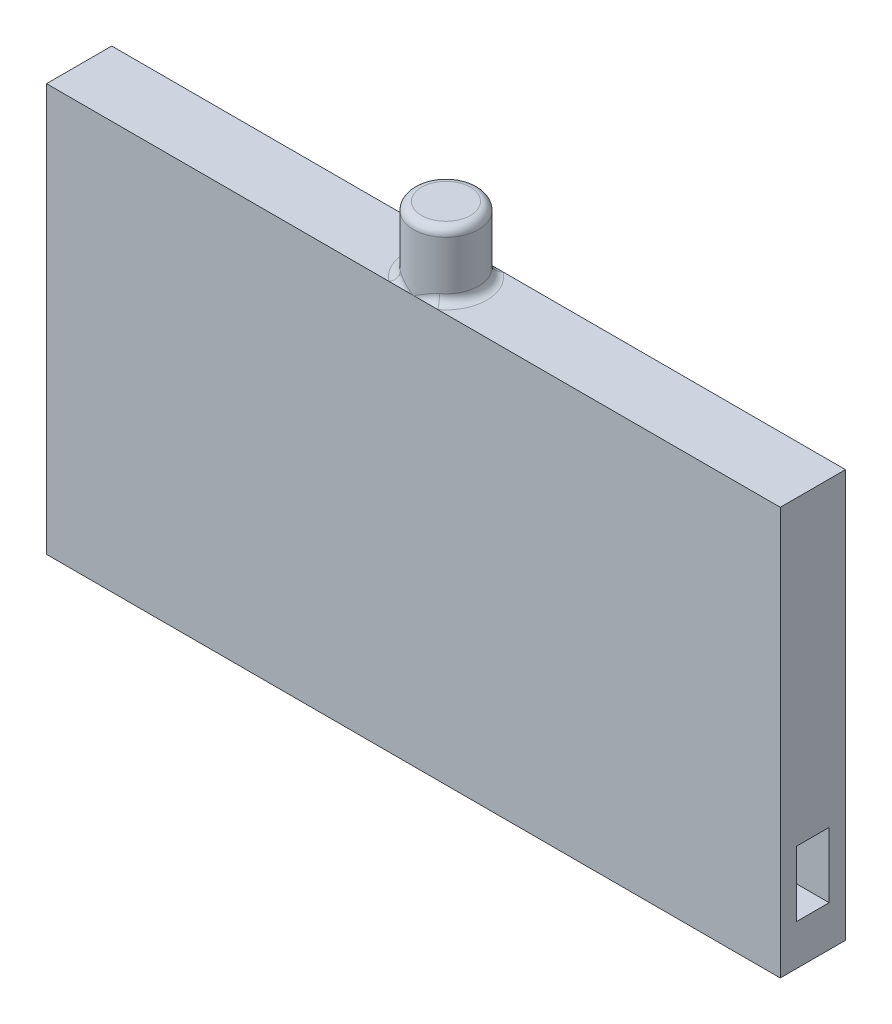
ISO-10303-21;
HEADER;
FILE_DESCRIPTION(('STEP AP214'),'2;1');
FILE_NAME('part.step','',(''),(''),'','','');
FILE_SCHEMA(('AUTOMOTIVE_DESIGN { 1 0 10303 214 1 1 1 1 }'));
ENDSEC;
DATA;
#1=APPLICATION_CONTEXT('core data for automotive mechanical design processes');
#2=APPLICATION_PROTOCOL_DEFINITION('international standard','automotive_design',2000,#1);
#3=PRODUCT_CONTEXT('',#1,'mechanical');
#4=PRODUCT('Part','Part','',(#3));
#5=PRODUCT_RELATED_PRODUCT_CATEGORY('part','',(#4));
#6=PRODUCT_DEFINITION_FORMATION('','',#4);
#7=PRODUCT_DEFINITION_CONTEXT('part definition',#1,'design');
#8=PRODUCT_DEFINITION('design','',#6,#7);
#9=PRODUCT_DEFINITION_SHAPE('','',#8);
#10=(LENGTH_UNIT() NAMED_UNIT(*) SI_UNIT(.MILLI.,.METRE.));
#11=(NAMED_UNIT(*) PLANE_ANGLE_UNIT() SI_UNIT($,.RADIAN.));
#12=(NAMED_UNIT(*) SI_UNIT($,.STERADIAN.) SOLID_ANGLE_UNIT());
#13=UNCERTAINTY_MEASURE_WITH_UNIT(LENGTH_MEASURE(1.E-05),#10,'distance_accuracy_value','');
#14=(GEOMETRIC_REPRESENTATION_CONTEXT(3) GLOBAL_UNCERTAINTY_ASSIGNED_CONTEXT((#13)) GLOBAL_UNIT_ASSIGNED_CONTEXT((#10,
#11,#12)) REPRESENTATION_CONTEXT('',''));
#15=CARTESIAN_POINT('',(0.,0.,0.));
#16=DIRECTION('',(0.,0.,1.));
#17=DIRECTION('',(1.,0.,0.));
#18=AXIS2_PLACEMENT_3D('',#15,#16,#17);
#19=CARTESIAN_POINT('',(0.,12.7,0.));
#20=DIRECTION('',(0.,-1.,0.));
#21=DIRECTION('',(0.,0.,1.));
#22=AXIS2_PLACEMENT_3D('',#19,#20,#21);
#23=PLANE('',#22);
#24=DIRECTION('',(-1.,0.,0.));
#25=VECTOR('',#24,1.);
#26=CARTESIAN_POINT('',(-9.906,12.7,15.7398333107177));
#27=LINE('',#26,#25);
#28=CARTESIAN_POINT('',(12.954,12.7,15.7398333107177));
#29=VERTEX_POINT('',#28);
#30=CARTESIAN_POINT('',(2.286,12.7,15.7398333107177));
#31=VERTEX_POINT('',#30);
#32=EDGE_CURVE('E192',#29,#31,#27,.T.);
#33=ORIENTED_EDGE('',*,*,#32,.F.);
#34=DIRECTION('',(0.,0.,1.));
#35=VECTOR('',#34,1.);
#36=CARTESIAN_POINT('',(12.954,12.7,13.7078333107177));
#37=LINE('',#36,#35);
#38=CARTESIAN_POINT('',(12.954,12.7,13.7078333107177));
#39=VERTEX_POINT('',#38);
#40=EDGE_CURVE('E186',#39,#29,#37,.T.);
#41=ORIENTED_EDGE('',*,*,#40,.F.);
#42=DIRECTION('',(1.,0.,0.));
#43=VECTOR('',#42,1.);
#44=CARTESIAN_POINT('',(-9.906,12.7,13.7078333107177));
#45=LINE('',#44,#43);
#46=CARTESIAN_POINT('',(2.286,12.7,13.7078333107177));
#47=VERTEX_POINT('',#46);
#48=EDGE_CURVE('E181',#47,#39,#45,.T.);
#49=ORIENTED_EDGE('',*,*,#48,.F.);
#50=CARTESIAN_POINT('',(1.524,12.7,14.7238333107177));
#51=DIRECTION('',(0.,1.,0.));
#52=DIRECTION('',(0.,0.,1.));
#53=AXIS2_PLACEMENT_3D('',#50,#51,#52);
#54=CIRCLE('',#53,1.27);
#55=EDGE_CURVE('E11',#31,#47,#54,.T.);
#56=ORIENTED_EDGE('',*,*,#55,.F.);
#57=EDGE_LOOP('',(#33,#41,#49,#56));
#58=FACE_BOUND('',#57,.T.);
#59=ADVANCED_FACE('F39',(#58),#23,.F.);
#60=CARTESIAN_POINT('',(-9.906,12.7,13.7078333107177));
#61=DIRECTION('',(1.,0.,0.));
#62=DIRECTION('',(0.,0.,1.));
#63=AXIS2_PLACEMENT_3D('',#60,#61,#62);
#64=PLANE('',#63);
#65=DIRECTION('',(0.,0.,-1.));
#66=VECTOR('',#65,1.);
#67=CARTESIAN_POINT('',(-9.906,0.,13.7078333107177));
#68=LINE('',#67,#66);
#69=CARTESIAN_POINT('',(-9.906,0.,15.7398333107177));
#70=VERTEX_POINT('',#69);
#71=CARTESIAN_POINT('',(-9.906,0.,13.7078333107177));
#72=VERTEX_POINT('',#71);
#73=EDGE_CURVE('E198',#70,#72,#68,.T.);
#74=ORIENTED_EDGE('',*,*,#73,.F.);
#75=DIRECTION('',(0.,-1.,0.));
#76=VECTOR('',#75,1.);
#77=CARTESIAN_POINT('',(-9.906,12.7,15.7398333107177));
#78=LINE('',#77,#76);
#79=CARTESIAN_POINT('',(-9.906,12.7,15.7398333107177));
#80=VERTEX_POINT('',#79);
#81=EDGE_CURVE('E195',#80,#70,#78,.T.);
#82=ORIENTED_EDGE('',*,*,#81,.F.);
#83=DIRECTION('',(0.,0.,-1.));
#84=VECTOR('',#83,1.);
#85=CARTESIAN_POINT('',(-9.906,12.7,13.7078333107177));
#86=LINE('',#85,#84);
#87=CARTESIAN_POINT('',(-9.906,12.7,13.7078333107177));
#88=VERTEX_POINT('',#87);
#89=EDGE_CURVE('E178',#80,#88,#86,.T.);
#90=ORIENTED_EDGE('',*,*,#89,.T.);
#91=DIRECTION('',(0.,-1.,0.));
#92=VECTOR('',#91,1.);
#93=CARTESIAN_POINT('',(-9.906,12.7,13.7078333107177));
#94=LINE('',#93,#92);
#95=EDGE_CURVE('E217',#88,#72,#94,.T.);
#96=ORIENTED_EDGE('',*,*,#95,.T.);
#97=EDGE_LOOP('',(#74,#82,#90,#96));
#98=FACE_BOUND('',#97,.T.);
#99=ADVANCED_FACE('F352',(#98),#64,.F.);
#100=CARTESIAN_POINT('',(-9.906,12.7,13.7078333107177));
#101=DIRECTION('',(0.,0.,1.));
#102=DIRECTION('',(-1.,0.,0.));
#103=AXIS2_PLACEMENT_3D('',#100,#101,#102);
#104=PLANE('',#103);
#105=DIRECTION('',(1.,0.,0.));
#106=VECTOR('',#105,1.);
#107=CARTESIAN_POINT('',(-9.906,0.,13.7078333107177));
#108=LINE('',#107,#106);
#109=CARTESIAN_POINT('',(12.954,0.,13.7078333107177));
#110=VERTEX_POINT('',#109);
#111=EDGE_CURVE('E201',#72,#110,#108,.T.);
#112=ORIENTED_EDGE('',*,*,#111,.F.);
#113=ORIENTED_EDGE('',*,*,#95,.F.);
#114=CARTESIAN_POINT('',(0.762000000000002,12.7,13.7078333107177));
#115=VERTEX_POINT('',#114);
#116=EDGE_CURVE('E183',#88,#115,#45,.T.);
#117=ORIENTED_EDGE('',*,*,#116,.T.);
#118=CARTESIAN_POINT('',(1.524,12.7,13.7078333107177));
#119=VERTEX_POINT('',#118);
#120=EDGE_CURVE('E187',#115,#119,#45,.T.);
#121=ORIENTED_EDGE('',*,*,#120,.T.);
#122=EDGE_CURVE('E188',#119,#47,#45,.T.);
#123=ORIENTED_EDGE('',*,*,#122,.T.);
#124=ORIENTED_EDGE('',*,*,#48,.T.);
#125=DIRECTION('',(0.,-1.,0.));
#126=VECTOR('',#125,1.);
#127=CARTESIAN_POINT('',(12.954,12.7,13.7078333107177));
#128=LINE('',#127,#126);
#129=EDGE_CURVE('E214',#39,#110,#128,.T.);
#130=ORIENTED_EDGE('',*,*,#129,.T.);
#131=EDGE_LOOP('',(#112,#113,#117,#121,#123,#124,#130));
#132=FACE_BOUND('',#131,.T.);
#133=ADVANCED_FACE('F348',(#132),#104,.F.);
#134=CARTESIAN_POINT('',(12.954,12.7,13.7078333107177));
#135=DIRECTION('',(-1.,0.,0.));
#136=DIRECTION('',(0.,0.,-1.));
#137=AXIS2_PLACEMENT_3D('',#134,#135,#136);
#138=PLANE('',#137);
#139=DIRECTION('',(0.,0.,1.));
#140=VECTOR('',#139,1.);
#141=CARTESIAN_POINT('',(12.954,1.27,14.2158333107177));
#142=LINE('',#141,#140);
#143=CARTESIAN_POINT('',(12.954,1.27,14.2158333107177));
#144=VERTEX_POINT('',#143);
#145=CARTESIAN_POINT('',(12.954,1.27,15.2318333107177));
#146=VERTEX_POINT('',#145);
#147=EDGE_CURVE('E154',#144,#146,#142,.T.);
#148=ORIENTED_EDGE('',*,*,#147,.T.);
#149=DIRECTION('',(0.,1.,0.));
#150=VECTOR('',#149,1.);
#151=CARTESIAN_POINT('',(12.954,1.27,15.2318333107177));
#152=LINE('',#151,#150);
#153=CARTESIAN_POINT('',(12.954,3.302,15.2318333107177));
#154=VERTEX_POINT('',#153);
#155=EDGE_CURVE('E163',#146,#154,#152,.T.);
#156=ORIENTED_EDGE('',*,*,#155,.T.);
#157=DIRECTION('',(0.,0.,-1.));
#158=VECTOR('',#157,1.);
#159=CARTESIAN_POINT('',(12.954,3.302,14.2158333107177));
#160=LINE('',#159,#158);
#161=CARTESIAN_POINT('',(12.954,3.302,14.2158333107177));
#162=VERTEX_POINT('',#161);
#163=EDGE_CURVE('E160',#154,#162,#160,.T.);
#164=ORIENTED_EDGE('',*,*,#163,.T.);
#165=DIRECTION('',(0.,-1.,0.));
#166=VECTOR('',#165,1.);
#167=CARTESIAN_POINT('',(12.954,1.27,14.2158333107177));
#168=LINE('',#167,#166);
#169=EDGE_CURVE('E168',#162,#144,#168,.T.);
#170=ORIENTED_EDGE('',*,*,#169,.T.);
#171=EDGE_LOOP('',(#148,#156,#164,#170));
#172=FACE_BOUND('',#171,.T.);
#173=DIRECTION('',(0.,0.,1.));
#174=VECTOR('',#173,1.);
#175=CARTESIAN_POINT('',(12.954,0.,13.7078333107177));
#176=LINE('',#175,#174);
#177=CARTESIAN_POINT('',(12.954,0.,15.7398333107177));
#178=VERTEX_POINT('',#177);
#179=EDGE_CURVE('E205',#110,#178,#176,.T.);
#180=ORIENTED_EDGE('',*,*,#179,.F.);
#181=ORIENTED_EDGE('',*,*,#129,.F.);
#182=ORIENTED_EDGE('',*,*,#40,.T.);
#183=DIRECTION('',(0.,-1.,0.));
#184=VECTOR('',#183,1.);
#185=CARTESIAN_POINT('',(12.954,12.7,15.7398333107177));
#186=LINE('',#185,#184);
#187=EDGE_CURVE('E211',#29,#178,#186,.T.);
#188=ORIENTED_EDGE('',*,*,#187,.T.);
#189=EDGE_LOOP('',(#180,#181,#182,#188));
#190=FACE_BOUND('',#189,.T.);
#191=ADVANCED_FACE('F327',(#172,#190),#138,.F.);
#192=CARTESIAN_POINT('',(-9.906,12.7,15.7398333107177));
#193=DIRECTION('',(0.,0.,-1.));
#194=DIRECTION('',(1.,0.,0.));
#195=AXIS2_PLACEMENT_3D('',#192,#193,#194);
#196=PLANE('',#195);
#197=DIRECTION('',(-1.,0.,0.));
#198=VECTOR('',#197,1.);
#199=CARTESIAN_POINT('',(-9.906,0.,15.7398333107177));
#200=LINE('',#199,#198);
#201=EDGE_CURVE('E182',#178,#70,#200,.T.);
#202=ORIENTED_EDGE('',*,*,#201,.F.);
#203=ORIENTED_EDGE('',*,*,#187,.F.);
#204=ORIENTED_EDGE('',*,*,#32,.T.);
#205=CARTESIAN_POINT('',(1.524,12.7,15.7398333107177));
#206=VERTEX_POINT('',#205);
#207=EDGE_CURVE('E196',#31,#206,#27,.T.);
#208=ORIENTED_EDGE('',*,*,#207,.T.);
#209=CARTESIAN_POINT('',(0.762000000000002,12.7,15.7398333107177));
#210=VERTEX_POINT('',#209);
#211=EDGE_CURVE('E197',#206,#210,#27,.T.);
#212=ORIENTED_EDGE('',*,*,#211,.T.);
#213=EDGE_CURVE('E191',#210,#80,#27,.T.);
#214=ORIENTED_EDGE('',*,*,#213,.T.);
#215=ORIENTED_EDGE('',*,*,#81,.T.);
#216=EDGE_LOOP('',(#202,#203,#204,#208,#212,#214,#215));
#217=FACE_BOUND('',#216,.T.);
#218=ADVANCED_FACE('F323',(#217),#196,.F.);
#219=ORIENTED_EDGE('',*,*,#116,.F.);
#220=ORIENTED_EDGE('',*,*,#89,.F.);
#221=ORIENTED_EDGE('',*,*,#213,.F.);
#222=CARTESIAN_POINT('',(1.524,12.7,14.7238333107177));
#223=DIRECTION('',(0.,1.,0.));
#224=DIRECTION('',(0.,0.,1.));
#225=AXIS2_PLACEMENT_3D('',#222,#223,#224);
#226=CIRCLE('',#225,1.27);
#227=EDGE_CURVE('E52',#115,#210,#226,.T.);
#228=ORIENTED_EDGE('',*,*,#227,.F.);
#229=EDGE_LOOP('',(#219,#220,#221,#228));
#230=FACE_BOUND('',#229,.T.);
#231=ADVANCED_FACE('F250',(#230),#23,.F.);
#232=CARTESIAN_POINT('',(0.,0.,0.));
#233=DIRECTION('',(0.,-1.,0.));
#234=DIRECTION('',(0.,0.,1.));
#235=AXIS2_PLACEMENT_3D('',#232,#233,#234);
#236=PLANE('',#235);
#237=ORIENTED_EDGE('',*,*,#73,.T.);
#238=ORIENTED_EDGE('',*,*,#111,.T.);
#239=ORIENTED_EDGE('',*,*,#179,.T.);
#240=ORIENTED_EDGE('',*,*,#201,.T.);
#241=EDGE_LOOP('',(#237,#238,#239,#240));
#242=FACE_BOUND('',#241,.T.);
#243=ADVANCED_FACE('F247',(#242),#236,.T.);
#244=CARTESIAN_POINT('',(1.524,14.732,14.7238333107177));
#245=DIRECTION('',(0.,-1.,0.));
#246=DIRECTION('',(0.,0.,1.));
#247=AXIS2_PLACEMENT_3D('',#244,#245,#246);
#248=CYLINDRICAL_SURFACE('',#247,1.016);
#249=CARTESIAN_POINT('',(1.524,14.478,14.7238333107177));
#250=DIRECTION('',(0.,-1.,0.));
#251=DIRECTION('',(0.,0.,-1.));
#252=AXIS2_PLACEMENT_3D('',#249,#250,#251);
#253=CIRCLE('',#252,1.016);
#254=CARTESIAN_POINT('',(1.524,14.478,13.7078333107177));
#255=VERTEX_POINT('',#254);
#256=EDGE_CURVE('E223',#255,#255,#253,.F.);
#257=ORIENTED_EDGE('',*,*,#256,.F.);
#258=EDGE_LOOP('',(#257));
#259=FACE_BOUND('',#258,.T.);
#260=CARTESIAN_POINT('',(2.4064924989913,12.7,15.7398333107177));
#261=CARTESIAN_POINT('',(2.15762912961619,12.6047525616474,15.5243932420477));
#262=CARTESIAN_POINT('',(2.22999399919304,12.9323092693618,15.4544689744403));
#263=CARTESIAN_POINT('',(2.38823837720513,12.7,15.7398333107177));
#264=CARTESIAN_POINT('',(2.16013043971291,12.6217760831303,15.5193105706868));
#265=CARTESIAN_POINT('',(2.21539070176302,12.9400643662147,15.4686076936029));
#266=CARTESIAN_POINT('',(2.36902813833045,12.7,15.7398333107177));
#267=CARTESIAN_POINT('',(2.15898944492113,12.6391526553524,15.5187327865888));
#268=CARTESIAN_POINT('',(2.20002251066382,12.9454546331779,15.4825825451088));
#269=CARTESIAN_POINT('',(2.32936744310018,12.7,15.7398333107177));
#270=CARTESIAN_POINT('',(2.1506264079769,12.6710582418321,15.5237704354303));
#271=CARTESIAN_POINT('',(2.16829395448067,12.9523528845866,15.5096839311462));
#272=CARTESIAN_POINT('',(2.30893224496265,12.7,15.7398333107177));
#273=CARTESIAN_POINT('',(2.14378702017022,12.685768224025,15.5289959824419));
#274=CARTESIAN_POINT('',(2.15194579597119,12.9539013090713,15.5228178720088));
#275=CARTESIAN_POINT('',(2.25525934625124,12.7,15.7398333107177));
#276=CARTESIAN_POINT('',(2.12080212618187,12.7179163845327,15.5462268347036));
#277=CARTESIAN_POINT('',(2.10900747699933,12.9541429622308,15.5551591211067));
#278=CARTESIAN_POINT('',(2.22131553817615,12.7,15.7398333107177));
#279=CARTESIAN_POINT('',(2.10163664566155,12.7335982565379,15.5603817747969));
#280=CARTESIAN_POINT('',(2.0818524305337,12.9507269739582,15.573601893695));
#281=CARTESIAN_POINT('',(2.15182987843322,12.7,15.7398333107177));
#282=CARTESIAN_POINT('',(2.05682597770893,12.75617974827,15.5899736995301));
#283=CARTESIAN_POINT('',(2.02626390275384,12.939025664532,15.607609498478));
#284=CARTESIAN_POINT('',(2.11627841213767,12.7,15.7398333107177));
#285=CARTESIAN_POINT('',(2.03128975608147,12.7636517012701,15.605494761524));
#286=CARTESIAN_POINT('',(1.99782272973763,12.9307060312762,15.6231530248784));
#287=CARTESIAN_POINT('',(2.02310841025931,12.7,15.7398333107177));
#288=CARTESIAN_POINT('',(1.9614353813307,12.774387062972,15.6428992688062));
#289=CARTESIAN_POINT('',(1.92328672816379,12.904866876462,15.6594677944974));
#290=CARTESIAN_POINT('',(1.96479868694514,12.7,15.7398333107177));
#291=CARTESIAN_POINT('',(1.91305433596181,12.7738815954522,15.6646704824849));
#292=CARTESIAN_POINT('',(1.87663894934852,12.8848140642996,15.6779437854235));
#293=CARTESIAN_POINT('',(1.84723283436228,12.7,15.7398333107177));
#294=CARTESIAN_POINT('',(1.81312650696352,12.7638351499827,15.6996887709867));
#295=CARTESIAN_POINT('',(1.78258626727586,12.8402683605976,15.7076154347474));
#296=CARTESIAN_POINT('',(1.78797739389608,12.7,15.7398333107177));
#297=CARTESIAN_POINT('',(1.76064846188578,12.7545968557819,15.7137001602763));
#298=CARTESIAN_POINT('',(1.73518191506025,12.8157785771441,15.718816164421));
#299=CARTESIAN_POINT('',(1.66265825706662,12.7,15.7398333107177));
#300=CARTESIAN_POINT('',(1.6495216086822,12.7311085861398,15.733821241473));
#301=CARTESIAN_POINT('',(1.63492660571583,12.7619811321778,15.7351642232897));
#302=CARTESIAN_POINT('',(1.59653494933849,12.7,15.7398333107177));
#303=CARTESIAN_POINT('',(1.5893044812909,12.716222578597,15.7394740322518));
#304=CARTESIAN_POINT('',(1.58202795947278,12.7324377091468,15.7395495368551));
#305=CARTESIAN_POINT('',(1.52833750695247,12.7,15.7398333107177));
#306=CARTESIAN_POINT('',(1.52790377917589,12.7009699098801,15.7398278934925));
#307=CARTESIAN_POINT('',(1.52747000556191,12.7019397824138,15.7398288607023));
#308=CARTESIAN_POINT('',(1.52616869484347,12.7,15.7398333107177));
#309=CARTESIAN_POINT('',(1.52595182230564,12.7004849426041,15.7398334575026));
#310=CARTESIAN_POINT('',(1.52573495587471,12.70096985959,15.7398333042165));
#311=CARTESIAN_POINT('',(1.524,12.7,15.7398333107177));
#312=CARTESIAN_POINT('',(1.524,12.7,15.7398333107177));
#313=CARTESIAN_POINT('',(1.524,12.7,15.7398333107177));
#314=(BOUNDED_SURFACE() B_SPLINE_SURFACE(3,2,((#260,#261,#262),(#263,#264,#265),(#266,#267,
#268),(#269,#270,#271),(#272,#273,#274),(#275,#276,#277),(#278,#279,#280),(#281,#282,#283),
(#284,#285,#286),(#287,#288,#289),(#290,#291,#292),(#293,#294,#295),(#296,#297,#298),(#299,#300,
#301),(#302,#303,#304),(#305,#306,#307),(#308,#309,#310),(#311,#312,#313)),.UNSPECIFIED.,.F.,
.F.,.F.) B_SPLINE_SURFACE_WITH_KNOTS((4,2,2,2,2,2,2,2,4),(3,3),(0.,0.0793252790118578,
0.157811952154223,0.280673172074431,0.404404464946702,0.600842987831006,0.797144434390673,
1.01412570681678,1.02125313817637),(0.,1.),
.UNSPECIFIED.) GEOMETRIC_REPRESENTATION_ITEM() RATIONAL_B_SPLINE_SURFACE(((1.,0.595490754317653,
1.),(1.,0.614138792536777,1.),(1.,0.632907033109889,1.),(1.,0.669779348387161,1.),(1.,
0.687888346908783,1.),(1.,0.73287636210131,1.),(1.,0.758925185024582,1.),(1.,0.807344062701329,
1.),(1.,0.829686758942298,1.),(1.,0.882140467793232,1.),(1.,0.909101389562458,1.),(1.,
0.952536676117571,1.),(1.,0.969018345376008,1.),(1.,0.993099717373105,1.),(1.,0.999580814566414,
1.),(1.,0.999993437605627,1.),(1.,0.999999998399152,1.),(1.,1.,1.))) REPRESENTATION_ITEM('') SURFACE());
#315=CARTESIAN_POINT('',(2.22999399919304,12.9323092693618,15.4544689744403));
#316=CARTESIAN_POINT('',(2.21539070176302,12.9400643662147,15.4686076936029));
#317=CARTESIAN_POINT('',(2.20002251066382,12.9454546331779,15.4825825451088));
#318=CARTESIAN_POINT('',(2.16829395448067,12.9523528845866,15.5096839311462));
#319=CARTESIAN_POINT('',(2.15194579597118,12.9539013090713,15.5228178720088));
#320=CARTESIAN_POINT('',(2.10900747699933,12.9541429622308,15.5551591211067));
#321=CARTESIAN_POINT('',(2.0818524305337,12.9507269739582,15.573601893695));
#322=CARTESIAN_POINT('',(2.02626390275384,12.939025664532,15.607609498478));
#323=CARTESIAN_POINT('',(1.99782272973763,12.9307060312762,15.6231530248784));
#324=CARTESIAN_POINT('',(1.92328672816379,12.904866876462,15.6594677944974));
#325=CARTESIAN_POINT('',(1.87663894934852,12.8848140642996,15.6779437854235));
#326=CARTESIAN_POINT('',(1.78258626727586,12.8402683605976,15.7076154347474));
#327=CARTESIAN_POINT('',(1.73518191506025,12.8157785771441,15.718816164421));
#328=CARTESIAN_POINT('',(1.63492660571583,12.7619811321777,15.7351642232897));
#329=CARTESIAN_POINT('',(1.58202795947279,12.7324377091468,15.7395495368551));
#330=CARTESIAN_POINT('',(1.52747000556191,12.7019397824138,15.7398288607023));
#331=CARTESIAN_POINT('',(1.5257349558747,12.70096985959,15.7398333042165));
#332=CARTESIAN_POINT('',(1.524,12.7,15.7398333107177));
#333=B_SPLINE_CURVE_WITH_KNOTS('',3,(#315,#316,#317,#318,#319,#320,#321,#322,#323,#324,#325,
#326,#327,#328,#329,#330,#331,#332),.UNSPECIFIED.,.F.,.F.,(4,2,2,2,2,2,2,2,4),(0.,
0.0793252790118578,0.157811952154223,0.280673172074431,0.404404464946702,0.600842987831006,
0.797144434390673,1.01412570681678,1.02125313817637),.UNSPECIFIED.);
#334=CARTESIAN_POINT('',(2.1336,12.954,15.5366333107177));
#335=VERTEX_POINT('',#334);
#336=EDGE_CURVE('E226',#335,#206,#333,.T.);
#337=ORIENTED_EDGE('',*,*,#336,.F.);
#338=CARTESIAN_POINT('',(1.524,12.954,14.7238333107177));
#339=DIRECTION('',(0.,1.,0.));
#340=DIRECTION('',(0.,0.,1.));
#341=AXIS2_PLACEMENT_3D('',#338,#339,#340);
#342=CIRCLE('',#341,1.016);
#343=CARTESIAN_POINT('',(2.1336,12.954,13.9110333107177));
#344=VERTEX_POINT('',#343);
#345=EDGE_CURVE('E235',#344,#335,#342,.F.);
#346=ORIENTED_EDGE('',*,*,#345,.F.);
#347=CARTESIAN_POINT('',(2.22999399919313,12.9323092693617,13.9931976469951));
#348=CARTESIAN_POINT('',(2.15762912961617,12.6047525616473,13.9232733793876));
#349=CARTESIAN_POINT('',(2.40649249899141,12.7,13.7078333107177));
#350=CARTESIAN_POINT('',(2.21539070176311,12.9400643662146,13.9790589278325));
#351=CARTESIAN_POINT('',(2.16013043971291,12.6217760831301,13.9283560507486));
#352=CARTESIAN_POINT('',(2.38823837720525,12.7,13.7078333107177));
#353=CARTESIAN_POINT('',(2.20002251066392,12.9454546331779,13.9650840763266));
#354=CARTESIAN_POINT('',(2.15898944492114,12.6391526553522,13.9289338348466));
#355=CARTESIAN_POINT('',(2.36902813833058,12.7,13.7078333107177));
#356=CARTESIAN_POINT('',(2.1682939544808,12.9523528845866,13.9379826902892));
#357=CARTESIAN_POINT('',(2.15062640797695,12.671058241832,13.9238961860051));
#358=CARTESIAN_POINT('',(2.32936744310033,12.7,13.7078333107177));
#359=CARTESIAN_POINT('',(2.15194579597132,12.9539013090713,13.9248487494267));
#360=CARTESIAN_POINT('',(2.14378702017029,12.6857682240248,13.9186706389935));
#361=CARTESIAN_POINT('',(2.30893224496282,12.7,13.7078333107177));
#362=CARTESIAN_POINT('',(2.10900747699949,12.9541429622308,13.8925075003288));
#363=CARTESIAN_POINT('',(2.12080212618198,12.7179163845326,13.9014397867318));
#364=CARTESIAN_POINT('',(2.25525934625144,12.7,13.7078333107177));
#365=CARTESIAN_POINT('',(2.08185243053389,12.9507269739582,13.8740647277405));
#366=CARTESIAN_POINT('',(2.10163664566168,12.7335982565378,13.8872848466386));
#367=CARTESIAN_POINT('',(2.22131553817638,12.7,13.7078333107177));
#368=CARTESIAN_POINT('',(2.02626390275406,12.939025664532,13.8400571229575));
#369=CARTESIAN_POINT('',(2.05682597770912,12.7561797482699,13.8576929219054));
#370=CARTESIAN_POINT('',(2.15182987843349,12.7,13.7078333107177));
#371=CARTESIAN_POINT('',(1.99782272973787,12.9307060312763,13.8245135965571));
#372=CARTESIAN_POINT('',(2.03128975608169,12.76365170127,13.8421718599115));
#373=CARTESIAN_POINT('',(2.11627841213796,12.7,13.7078333107177));
#374=CARTESIAN_POINT('',(1.92328672816407,12.9048668764621,13.7881988269381));
#375=CARTESIAN_POINT('',(1.96143538133098,12.774387062972,13.8047673526293));
#376=CARTESIAN_POINT('',(2.02310841025966,12.7,13.7078333107177));
#377=CARTESIAN_POINT('',(1.87663894934882,12.8848140642998,13.7697228360119));
#378=CARTESIAN_POINT('',(1.91305433596213,12.7738815954522,13.7829961389506));
#379=CARTESIAN_POINT('',(1.96479868694552,12.7,13.7078333107177));
#380=CARTESIAN_POINT('',(1.78258626727621,12.8402683605977,13.7400511866881));
#381=CARTESIAN_POINT('',(1.8131265069639,12.7638351499827,13.7479778504488));
#382=CARTESIAN_POINT('',(1.84723283436272,12.7,13.7078333107177));
#383=CARTESIAN_POINT('',(1.73518191506063,12.8157785771443,13.7288504570145));
#384=CARTESIAN_POINT('',(1.76064846188619,12.7545968557819,13.7339664611591));
#385=CARTESIAN_POINT('',(1.78797739389655,12.7,13.7078333107177));
#386=CARTESIAN_POINT('',(1.63492660571611,12.7619811321779,13.7125023981457));
#387=CARTESIAN_POINT('',(1.64952160868251,12.7311085861399,13.7138453799624));
#388=CARTESIAN_POINT('',(1.66265825706696,12.7,13.7078333107177));
#389=CARTESIAN_POINT('',(1.58202795947292,12.7324377091469,13.7081170845803));
#390=CARTESIAN_POINT('',(1.58930448129105,12.7162225785971,13.7081925891836));
#391=CARTESIAN_POINT('',(1.59653494933866,12.7,13.7078333107177));
#392=CARTESIAN_POINT('',(1.52747000556191,12.7019397824138,13.7078377607331));
#393=CARTESIAN_POINT('',(1.52790377917589,12.7009699098801,13.7078387279428));
#394=CARTESIAN_POINT('',(1.52833750695247,12.7,13.7078333107177));
#395=CARTESIAN_POINT('',(1.52573495587471,12.70096985959,13.7078333172189));
#396=CARTESIAN_POINT('',(1.52595182230564,12.7004849426041,13.7078331639328));
#397=CARTESIAN_POINT('',(1.52616869484347,12.7,13.7078333107177));
#398=CARTESIAN_POINT('',(1.524,12.7,13.7078333107177));
#399=CARTESIAN_POINT('',(1.524,12.7,13.7078333107177));
#400=CARTESIAN_POINT('',(1.524,12.7,13.7078333107177));
#401=(BOUNDED_SURFACE() B_SPLINE_SURFACE(3,2,((#347,#348,#349),(#350,#351,#352),(#353,#354,
#355),(#356,#357,#358),(#359,#360,#361),(#362,#363,#364),(#365,#366,#367),(#368,#369,#370),
(#371,#372,#373),(#374,#375,#376),(#377,#378,#379),(#380,#381,#382),(#383,#384,#385),(#386,#387,
#388),(#389,#390,#391),(#392,#393,#394),(#395,#396,#397),(#398,#399,#400)),.UNSPECIFIED.,.F.,
.F.,.F.) B_SPLINE_SURFACE_WITH_KNOTS((4,2,2,2,2,2,2,2,4),(3,3),(0.,0.0793252790118218,
0.157811952154152,0.280673172074292,0.404404464946496,0.600842987830705,0.797144434390273,
1.01412570681693,1.02125313817653),(0.,1.),
.UNSPECIFIED.) GEOMETRIC_REPRESENTATION_ITEM() RATIONAL_B_SPLINE_SURFACE(((1.,0.595490754317544,
1.),(1.,0.614138792536657,1.),(1.,0.63290703310976,1.),(1.,0.669779348387017,1.),(1.,
0.687888346908635,1.),(1.,0.732876362101147,1.),(1.,0.758925185024413,1.),(1.,0.807344062701151,
1.),(1.,0.829686758942118,1.),(1.,0.882140467793056,1.),(1.,0.909101389562292,1.),(1.,
0.952536676117432,1.),(1.,0.969018345375888,1.),(1.,0.993099717373071,1.),(1.,0.999580814566413,
1.),(1.,0.999993437605627,1.),(1.,0.999999998399152,1.),(1.,1.,1.))) REPRESENTATION_ITEM('') SURFACE());
#402=CARTESIAN_POINT('',(2.22999399919313,12.9323092693617,13.9931976469951));
#403=CARTESIAN_POINT('',(2.21539070176311,12.9400643662146,13.9790589278325));
#404=CARTESIAN_POINT('',(2.20002251066392,12.9454546331779,13.9650840763266));
#405=CARTESIAN_POINT('',(2.1682939544808,12.9523528845866,13.9379826902892));
#406=CARTESIAN_POINT('',(2.15194579597132,12.9539013090713,13.9248487494267));
#407=CARTESIAN_POINT('',(2.10900747699949,12.9541429622308,13.8925075003288));
#408=CARTESIAN_POINT('',(2.08185243053389,12.9507269739582,13.8740647277405));
#409=CARTESIAN_POINT('',(2.02626390275406,12.939025664532,13.8400571229575));
#410=CARTESIAN_POINT('',(1.99782272973787,12.9307060312763,13.8245135965571));
#411=CARTESIAN_POINT('',(1.92328672816407,12.9048668764621,13.7881988269381));
#412=CARTESIAN_POINT('',(1.87663894934882,12.8848140642998,13.7697228360119));
#413=CARTESIAN_POINT('',(1.78258626727621,12.8402683605977,13.7400511866881));
#414=CARTESIAN_POINT('',(1.73518191506063,12.8157785771443,13.7288504570145));
#415=CARTESIAN_POINT('',(1.63492660571611,12.7619811321779,13.7125023981457));
#416=CARTESIAN_POINT('',(1.58202795947292,12.7324377091469,13.7081170845803));
#417=CARTESIAN_POINT('',(1.52747000556191,12.7019397824138,13.7078377607331));
#418=CARTESIAN_POINT('',(1.52573495587471,12.70096985959,13.7078333172189));
#419=CARTESIAN_POINT('',(1.524,12.7,13.7078333107177));
#420=B_SPLINE_CURVE_WITH_KNOTS('',3,(#402,#403,#404,#405,#406,#407,#408,#409,#410,#411,#412,
#413,#414,#415,#416,#417,#418,#419),.UNSPECIFIED.,.F.,.F.,(4,2,2,2,2,2,2,2,4),(0.,
0.0793252790118218,0.157811952154152,0.280673172074292,0.404404464946496,0.600842987830705,
0.797144434390273,1.01412570681693,1.02125313817653),.UNSPECIFIED.);
#421=EDGE_CURVE('E283',#119,#344,#420,.F.);
#422=ORIENTED_EDGE('',*,*,#421,.F.);
#423=CARTESIAN_POINT('',(0.641507501008704,12.7,13.7078333107177));
#424=CARTESIAN_POINT('',(0.890370870383815,12.6047525616474,13.9232733793877));
#425=CARTESIAN_POINT('',(0.818006000806964,12.9323092693618,13.993197646995));
#426=CARTESIAN_POINT('',(0.659761622794876,12.7,13.7078333107177));
#427=CARTESIAN_POINT('',(0.887869560287094,12.6217760831302,13.9283560507486));
#428=CARTESIAN_POINT('',(0.832609298236986,12.9400643662147,13.9790589278324));
#429=CARTESIAN_POINT('',(0.678971861669559,12.7,13.7078333107177));
#430=CARTESIAN_POINT('',(0.889010555078872,12.6391526553524,13.9289338348466));
#431=CARTESIAN_POINT('',(0.847977489336187,12.9454546331779,13.9650840763265));
#432=CARTESIAN_POINT('',(0.718632556899832,12.7,13.7078333107177));
#433=CARTESIAN_POINT('',(0.8973735920231,12.6710582418321,13.9238961860051));
#434=CARTESIAN_POINT('',(0.879706045519332,12.9523528845866,13.9379826902891));
#435=CARTESIAN_POINT('',(0.739067755037355,12.7,13.7078333107177));
#436=CARTESIAN_POINT('',(0.90421297982978,12.685768224025,13.9186706389934));
#437=CARTESIAN_POINT('',(0.896054204028822,12.9539013090713,13.9248487494266));
#438=CARTESIAN_POINT('',(0.792740653748772,12.7,13.7078333107177));
#439=CARTESIAN_POINT('',(0.927197873818133,12.7179163845328,13.9014397867317));
#440=CARTESIAN_POINT('',(0.93899252300068,12.9541429622308,13.8925075003287));
#441=CARTESIAN_POINT('',(0.826684461823858,12.7,13.7078333107177));
#442=CARTESIAN_POINT('',(0.946363354338456,12.7335982565379,13.8872848466385));
#443=CARTESIAN_POINT('',(0.966147569466305,12.9507269739582,13.8740647277404));
#444=CARTESIAN_POINT('',(0.896170121566795,12.7,13.7078333107177));
#445=CARTESIAN_POINT('',(0.991174022291078,12.75617974827,13.8576929219053));
#446=CARTESIAN_POINT('',(1.02173609724617,12.939025664532,13.8400571229574));
#447=CARTESIAN_POINT('',(0.931721587862345,12.7,13.7078333107177));
#448=CARTESIAN_POINT('',(1.01671024391854,12.7636517012701,13.8421718599114));
#449=CARTESIAN_POINT('',(1.05017727026238,12.9307060312762,13.8245135965569));
#450=CARTESIAN_POINT('',(1.0248915897407,12.7,13.7078333107177));
#451=CARTESIAN_POINT('',(1.08656461866931,12.7743870629721,13.8047673526291));
#452=CARTESIAN_POINT('',(1.12471327183622,12.904866876462,13.788198826938));
#453=CARTESIAN_POINT('',(1.08320131305487,12.7,13.7078333107177));
#454=CARTESIAN_POINT('',(1.1349456640382,12.7738815954522,13.7829961389504));
#455=CARTESIAN_POINT('',(1.1713610506515,12.8848140642996,13.7697228360118));
#456=CARTESIAN_POINT('',(1.20076716563774,12.7,13.7078333107177));
#457=CARTESIAN_POINT('',(1.2348734930365,12.7638351499827,13.7479778504487));
#458=CARTESIAN_POINT('',(1.26541373272416,12.8402683605975,13.740051186688));
#459=CARTESIAN_POINT('',(1.26002260610394,12.7,13.7078333107177));
#460=CARTESIAN_POINT('',(1.28735153811424,12.7545968557819,13.733966461159));
#461=CARTESIAN_POINT('',(1.31281808493976,12.8157785771441,13.7288504570144));
#462=CARTESIAN_POINT('',(1.38534174293339,12.7,13.7078333107177));
#463=CARTESIAN_POINT('',(1.39847839131781,12.7311085861398,13.7138453799624));
#464=CARTESIAN_POINT('',(1.41307339428417,12.7619811321777,13.7125023981457));
#465=CARTESIAN_POINT('',(1.4514650506615,12.7,13.7078333107177));
#466=CARTESIAN_POINT('',(1.4586955187091,12.716222578597,13.7081925891836));
#467=CARTESIAN_POINT('',(1.46597204052721,12.7324377091468,13.7081170845803));
#468=CARTESIAN_POINT('',(1.51966249304753,12.7,13.7078333107177));
#469=CARTESIAN_POINT('',(1.52009622082411,12.7009699098801,13.7078387279428));
#470=CARTESIAN_POINT('',(1.52052999443809,12.7019397824138,13.7078377607331));
#471=CARTESIAN_POINT('',(1.52183130515654,12.7,13.7078333107177));
#472=CARTESIAN_POINT('',(1.52204817769436,12.7004849426041,13.7078331639328));
#473=CARTESIAN_POINT('',(1.5222650441253,12.70096985959,13.7078333172189));
#474=CARTESIAN_POINT('',(1.524,12.7,13.7078333107177));
#475=CARTESIAN_POINT('',(1.524,12.7,13.7078333107177));
#476=CARTESIAN_POINT('',(1.524,12.7,13.7078333107177));
#477=(BOUNDED_SURFACE() B_SPLINE_SURFACE(3,2,((#423,#424,#425),(#426,#427,#428),(#429,#430,
#431),(#432,#433,#434),(#435,#436,#437),(#438,#439,#440),(#441,#442,#443),(#444,#445,#446),
(#447,#448,#449),(#450,#451,#452),(#453,#454,#455),(#456,#457,#458),(#459,#460,#461),(#462,#463,
#464),(#465,#466,#467),(#468,#469,#470),(#471,#472,#473),(#474,#475,#476)),.UNSPECIFIED.,.F.,
.F.,.F.) B_SPLINE_SURFACE_WITH_KNOTS((4,2,2,2,2,2,2,2,4),(3,3),(0.,0.0793252790118616,
0.15781195215423,0.28067317207444,0.404404464946713,0.600842987831021,0.797144434390689,
1.01412570681677,1.02125313817637),(0.,1.),
.UNSPECIFIED.) GEOMETRIC_REPRESENTATION_ITEM() RATIONAL_B_SPLINE_SURFACE(((1.,0.595490754317655,
1.),(1.,0.614138792536779,1.),(1.,0.632907033109892,1.),(1.,0.669779348387165,1.),(1.,
0.687888346908788,1.),(1.,0.732876362101316,1.),(1.,0.75892518502459,1.),(1.,0.807344062701337,
1.),(1.,0.829686758942304,1.),(1.,0.882140467793236,1.),(1.,0.909101389562463,1.),(1.,
0.952536676117575,1.),(1.,0.969018345376012,1.),(1.,0.993099717373106,1.),(1.,0.999580814566414,
1.),(1.,0.999993437605627,1.),(1.,0.999999998399152,1.),(1.,1.,1.))) REPRESENTATION_ITEM('') SURFACE());
#478=CARTESIAN_POINT('',(0.818006000806964,12.9323092693618,13.993197646995));
#479=CARTESIAN_POINT('',(0.832609298236986,12.9400643662147,13.9790589278324));
#480=CARTESIAN_POINT('',(0.847977489336187,12.9454546331779,13.9650840763265));
#481=CARTESIAN_POINT('',(0.879706045519332,12.9523528845866,13.9379826902891));
#482=CARTESIAN_POINT('',(0.896054204028822,12.9539013090713,13.9248487494266));
#483=CARTESIAN_POINT('',(0.93899252300068,12.9541429622308,13.8925075003287));
#484=CARTESIAN_POINT('',(0.966147569466305,12.9507269739582,13.8740647277404));
#485=CARTESIAN_POINT('',(1.02173609724617,12.939025664532,13.8400571229574));
#486=CARTESIAN_POINT('',(1.05017727026238,12.9307060312762,13.8245135965569));
#487=CARTESIAN_POINT('',(1.12471327183622,12.904866876462,13.788198826938));
#488=CARTESIAN_POINT('',(1.1713610506515,12.8848140642996,13.7697228360118));
#489=CARTESIAN_POINT('',(1.26541373272416,12.8402683605975,13.740051186688));
#490=CARTESIAN_POINT('',(1.31281808493976,12.8157785771441,13.7288504570144));
#491=CARTESIAN_POINT('',(1.41307339428417,12.7619811321777,13.7125023981457));
#492=CARTESIAN_POINT('',(1.46597204052721,12.7324377091468,13.7081170845803));
#493=CARTESIAN_POINT('',(1.52052999443809,12.7019397824138,13.7078377607331));
#494=CARTESIAN_POINT('',(1.5222650441253,12.70096985959,13.7078333172189));
#495=CARTESIAN_POINT('',(1.524,12.7,13.7078333107177));
#496=B_SPLINE_CURVE_WITH_KNOTS('',3,(#478,#479,#480,#481,#482,#483,#484,#485,#486,#487,#488,
#489,#490,#491,#492,#493,#494,#495),.UNSPECIFIED.,.F.,.F.,(4,2,2,2,2,2,2,2,4),(0.,
0.0793252790118616,0.15781195215423,0.28067317207444,0.404404464946713,0.600842987831021,
0.797144434390689,1.01412570681677,1.02125313817637),.UNSPECIFIED.);
#497=CARTESIAN_POINT('',(0.914400000000002,12.954,13.9110333107177));
#498=VERTEX_POINT('',#497);
#499=EDGE_CURVE('E289',#498,#119,#496,.T.);
#500=ORIENTED_EDGE('',*,*,#499,.F.);
#501=CARTESIAN_POINT('',(1.524,12.954,14.7238333107177));
#502=DIRECTION('',(0.,1.,0.));
#503=DIRECTION('',(0.,0.,1.));
#504=AXIS2_PLACEMENT_3D('',#501,#502,#503);
#505=CIRCLE('',#504,1.016);
#506=CARTESIAN_POINT('',(0.914400000000002,12.954,15.5366333107177));
#507=VERTEX_POINT('',#506);
#508=EDGE_CURVE('E296',#507,#498,#505,.F.);
#509=ORIENTED_EDGE('',*,*,#508,.F.);
#510=CARTESIAN_POINT('',(0.818006000806876,12.9323092693617,15.4544689744402));
#511=CARTESIAN_POINT('',(0.890370870383829,12.6047525616473,15.5243932420477));
#512=CARTESIAN_POINT('',(0.641507501008595,12.7,15.7398333107177));
#513=CARTESIAN_POINT('',(0.832609298236888,12.9400643662146,15.4686076936028));
#514=CARTESIAN_POINT('',(0.887869560287096,12.6217760831301,15.5193105706868));
#515=CARTESIAN_POINT('',(0.659761622794754,12.7,15.7398333107177));
#516=CARTESIAN_POINT('',(0.847977489336078,12.9454546331779,15.4825825451087));
#517=CARTESIAN_POINT('',(0.889010555078859,12.6391526553522,15.5187327865888));
#518=CARTESIAN_POINT('',(0.678971861669423,12.7,15.7398333107177));
#519=CARTESIAN_POINT('',(0.879706045519202,12.9523528845866,15.5096839311461));
#520=CARTESIAN_POINT('',(0.897373592023053,12.671058241832,15.5237704354303));
#521=CARTESIAN_POINT('',(0.718632556899669,12.7,15.7398333107177));
#522=CARTESIAN_POINT('',(0.896054204028682,12.9539013090713,15.5228178720087));
#523=CARTESIAN_POINT('',(0.904212979829715,12.6857682240248,15.5289959824419));
#524=CARTESIAN_POINT('',(0.739067755037179,12.7,15.7398333107177));
#525=CARTESIAN_POINT('',(0.938992523000511,12.9541429622308,15.5551591211065));
#526=CARTESIAN_POINT('',(0.927197873818024,12.7179163845326,15.5462268347036));
#527=CARTESIAN_POINT('',(0.792740653748561,12.7,15.7398333107177));
#528=CARTESIAN_POINT('',(0.966147569466119,12.9507269739582,15.5736018936949));
#529=CARTESIAN_POINT('',(0.946363354338319,12.7335982565378,15.5603817747968));
#530=CARTESIAN_POINT('',(0.826684461823625,12.7,15.7398333107177));
#531=CARTESIAN_POINT('',(1.02173609724594,12.939025664532,15.6076094984778));
#532=CARTESIAN_POINT('',(0.991174022290886,12.7561797482699,15.58997369953));
#533=CARTESIAN_POINT('',(0.896170121566516,12.7,15.7398333107177));
#534=CARTESIAN_POINT('',(1.05017727026214,12.9307060312763,15.6231530248783));
#535=CARTESIAN_POINT('',(1.01671024391832,12.76365170127,15.6054947615239));
#536=CARTESIAN_POINT('',(0.931721587862042,12.7,15.7398333107177));
#537=CARTESIAN_POINT('',(1.12471327183593,12.9048668764621,15.6594677944973));
#538=CARTESIAN_POINT('',(1.08656461866902,12.774387062972,15.6428992688061));
#539=CARTESIAN_POINT('',(1.02489158974034,12.7,15.7398333107177));
#540=CARTESIAN_POINT('',(1.17136105065118,12.8848140642998,15.6779437854234));
#541=CARTESIAN_POINT('',(1.13494566403788,12.7738815954522,15.6646704824848));
#542=CARTESIAN_POINT('',(1.08320131305448,12.7,15.7398333107177));
#543=CARTESIAN_POINT('',(1.26541373272379,12.8402683605977,15.7076154347473));
#544=CARTESIAN_POINT('',(1.2348734930361,12.7638351499827,15.6996887709866));
#545=CARTESIAN_POINT('',(1.20076716563728,12.7,15.7398333107177));
#546=CARTESIAN_POINT('',(1.31281808493937,12.8157785771443,15.7188161644209));
#547=CARTESIAN_POINT('',(1.28735153811381,12.7545968557819,15.7137001602762));
#548=CARTESIAN_POINT('',(1.26002260610345,12.7,15.7398333107177));
#549=CARTESIAN_POINT('',(1.4130733942839,12.7619811321779,15.7351642232897));
#550=CARTESIAN_POINT('',(1.39847839131749,12.7311085861399,15.733821241473));
#551=CARTESIAN_POINT('',(1.38534174293305,12.7,15.7398333107177));
#552=CARTESIAN_POINT('',(1.46597204052708,12.7324377091469,15.7395495368551));
#553=CARTESIAN_POINT('',(1.45869551870895,12.7162225785971,15.7394740322518));
#554=CARTESIAN_POINT('',(1.45146505066133,12.7,15.7398333107177));
#555=CARTESIAN_POINT('',(1.52052999443809,12.7019397824138,15.7398288607023));
#556=CARTESIAN_POINT('',(1.52009622082411,12.7009699098801,15.7398278934925));
#557=CARTESIAN_POINT('',(1.51966249304753,12.7,15.7398333107177));
#558=CARTESIAN_POINT('',(1.5222650441253,12.70096985959,15.7398333042165));
#559=CARTESIAN_POINT('',(1.52204817769436,12.7004849426041,15.7398334575026));
#560=CARTESIAN_POINT('',(1.52183130515654,12.7,15.7398333107177));
#561=CARTESIAN_POINT('',(1.524,12.7,15.7398333107177));
#562=CARTESIAN_POINT('',(1.524,12.7,15.7398333107177));
#563=CARTESIAN_POINT('',(1.524,12.7,15.7398333107177));
#564=(BOUNDED_SURFACE() B_SPLINE_SURFACE(3,2,((#510,#511,#512),(#513,#514,#515),(#516,#517,
#518),(#519,#520,#521),(#522,#523,#524),(#525,#526,#527),(#528,#529,#530),(#531,#532,#533),
(#534,#535,#536),(#537,#538,#539),(#540,#541,#542),(#543,#544,#545),(#546,#547,#548),(#549,#550,
#551),(#552,#553,#554),(#555,#556,#557),(#558,#559,#560),(#561,#562,#563)),.UNSPECIFIED.,.F.,
.F.,.F.) B_SPLINE_SURFACE_WITH_KNOTS((4,2,2,2,2,2,2,2,4),(3,3),(0.,0.0793252790118214,
0.157811952154154,0.280673172074297,0.404404464946499,0.600842987830704,0.797144434390273,
1.01412570681693,1.02125313817652),(0.,1.),
.UNSPECIFIED.) GEOMETRIC_REPRESENTATION_ITEM() RATIONAL_B_SPLINE_SURFACE(((1.,0.595490754317544,
1.),(1.,0.614138792536657,1.),(1.,0.63290703310976,1.),(1.,0.669779348387018,1.),(1.,
0.687888346908636,1.),(1.,0.73287636210115,1.),(1.,0.758925185024416,1.),(1.,0.807344062701154,
1.),(1.,0.82968675894212,1.),(1.,0.882140467793057,1.),(1.,0.909101389562292,1.),(1.,
0.952536676117432,1.),(1.,0.969018345375888,1.),(1.,0.993099717373071,1.),(1.,0.999580814566413,
1.),(1.,0.999993437605627,1.),(1.,0.999999998399152,1.),(1.,1.,1.))) REPRESENTATION_ITEM('') SURFACE());
#565=CARTESIAN_POINT('',(0.818006000806876,12.9323092693617,15.4544689744402));
#566=CARTESIAN_POINT('',(0.832609298236888,12.9400643662146,15.4686076936028));
#567=CARTESIAN_POINT('',(0.847977489336078,12.9454546331779,15.4825825451087));
#568=CARTESIAN_POINT('',(0.879706045519202,12.9523528845866,15.5096839311461));
#569=CARTESIAN_POINT('',(0.896054204028682,12.9539013090713,15.5228178720087));
#570=CARTESIAN_POINT('',(0.938992523000511,12.9541429622308,15.5551591211065));
#571=CARTESIAN_POINT('',(0.966147569466119,12.9507269739582,15.5736018936949));
#572=CARTESIAN_POINT('',(1.02173609724594,12.939025664532,15.6076094984778));
#573=CARTESIAN_POINT('',(1.05017727026214,12.9307060312763,15.6231530248783));
#574=CARTESIAN_POINT('',(1.12471327183593,12.9048668764621,15.6594677944973));
#575=CARTESIAN_POINT('',(1.17136105065118,12.8848140642998,15.6779437854234));
#576=CARTESIAN_POINT('',(1.26541373272379,12.8402683605977,15.7076154347473));
#577=CARTESIAN_POINT('',(1.31281808493937,12.8157785771443,15.7188161644209));
#578=CARTESIAN_POINT('',(1.4130733942839,12.7619811321779,15.7351642232897));
#579=CARTESIAN_POINT('',(1.46597204052708,12.7324377091469,15.7395495368551));
#580=CARTESIAN_POINT('',(1.52052999443809,12.7019397824138,15.7398288607023));
#581=CARTESIAN_POINT('',(1.5222650441253,12.70096985959,15.7398333042165));
#582=CARTESIAN_POINT('',(1.524,12.7,15.7398333107177));
#583=B_SPLINE_CURVE_WITH_KNOTS('',3,(#565,#566,#567,#568,#569,#570,#571,#572,#573,#574,#575,
#576,#577,#578,#579,#580,#581,#582),.UNSPECIFIED.,.F.,.F.,(4,2,2,2,2,2,2,2,4),(0.,
0.0793252790118214,0.157811952154154,0.280673172074297,0.404404464946499,0.600842987830704,
0.797144434390273,1.01412570681693,1.02125313817652),.UNSPECIFIED.);
#584=EDGE_CURVE('E300',#206,#507,#583,.F.);
#585=ORIENTED_EDGE('',*,*,#584,.F.);
#586=EDGE_LOOP('',(#337,#346,#422,#500,#509,#585));
#587=FACE_BOUND('',#586,.T.);
#588=ADVANCED_FACE('F241',(#259,#587),#248,.T.);
#589=CARTESIAN_POINT('',(1.524,14.732,14.7238333107177));
#590=DIRECTION('',(0.,1.,0.));
#591=DIRECTION('',(0.,0.,-1.));
#592=AXIS2_PLACEMENT_3D('',#589,#590,#591);
#593=PLANE('',#592);
#594=CARTESIAN_POINT('',(1.524,14.732,14.7238333107177));
#595=DIRECTION('',(0.,-1.,0.));
#596=DIRECTION('',(0.,0.,-1.));
#597=AXIS2_PLACEMENT_3D('',#594,#595,#596);
#598=CIRCLE('',#597,0.762);
#599=CARTESIAN_POINT('',(1.524,14.732,13.9618333107177));
#600=VERTEX_POINT('',#599);
#601=EDGE_CURVE('E220',#600,#600,#598,.T.);
#602=ORIENTED_EDGE('',*,*,#601,.F.);
#603=EDGE_LOOP('',(#602));
#604=FACE_BOUND('',#603,.T.);
#605=ADVANCED_FACE('F246',(#604),#593,.T.);
#606=CARTESIAN_POINT('',(1.524,14.478,14.7238333107177));
#607=DIRECTION('',(0.,1.,0.));
#608=DIRECTION('',(0.,0.,-1.));
#609=AXIS2_PLACEMENT_3D('',#606,#607,#608);
#610=TOROIDAL_SURFACE('',#609,0.762,0.254);
#611=ORIENTED_EDGE('',*,*,#256,.T.);
#612=EDGE_LOOP('',(#611));
#613=FACE_BOUND('',#612,.T.);
#614=ORIENTED_EDGE('',*,*,#601,.T.);
#615=EDGE_LOOP('',(#614));
#616=FACE_BOUND('',#615,.T.);
#617=ADVANCED_FACE('F409',(#613,#616),#610,.T.);
#618=ORIENTED_EDGE('',*,*,#120,.F.);
#619=CARTESIAN_POINT('',(0.76200000000018,12.954,13.7078333107176));
#620=DIRECTION('',(0.800000000000105,-3.15528443268148E-13,-0.59999999999986));
#621=DIRECTION('',(-0.59999999999986,0.,-0.800000000000105));
#622=AXIS2_PLACEMENT_3D('',#619,#620,#621);
#623=CIRCLE('',#622,0.254);
#624=EDGE_CURVE('E202',#115,#498,#623,.F.);
#625=ORIENTED_EDGE('',*,*,#624,.T.);
#626=ORIENTED_EDGE('',*,*,#499,.T.);
#627=EDGE_LOOP('',(#618,#625,#626));
#628=FACE_BOUND('',#627,.T.);
#629=ADVANCED_FACE('F265',(#628),#477,.F.);
#630=CARTESIAN_POINT('',(1.524,12.954,14.7238333107177));
#631=DIRECTION('',(0.,-1.,0.));
#632=DIRECTION('',(0.,0.,1.));
#633=AXIS2_PLACEMENT_3D('',#630,#631,#632);
#634=TOROIDAL_SURFACE('',#633,1.27,0.254);
#635=ORIENTED_EDGE('',*,*,#624,.F.);
#636=ORIENTED_EDGE('',*,*,#227,.T.);
#637=CARTESIAN_POINT('',(0.762000000000002,12.954,15.7398333107177));
#638=DIRECTION('',(0.799999999999999,0.,0.600000000000001));
#639=DIRECTION('',(0.600000000000001,0.,-0.799999999999999));
#640=AXIS2_PLACEMENT_3D('',#637,#638,#639);
#641=CIRCLE('',#640,0.254);
#642=EDGE_CURVE('E309',#210,#507,#641,.T.);
#643=ORIENTED_EDGE('',*,*,#642,.T.);
#644=ORIENTED_EDGE('',*,*,#508,.T.);
#645=EDGE_LOOP('',(#635,#636,#643,#644));
#646=FACE_BOUND('',#645,.T.);
#647=ADVANCED_FACE('F403',(#646),#634,.F.);
#648=ORIENTED_EDGE('',*,*,#584,.T.);
#649=ORIENTED_EDGE('',*,*,#642,.F.);
#650=ORIENTED_EDGE('',*,*,#211,.F.);
#651=EDGE_LOOP('',(#648,#649,#650));
#652=FACE_BOUND('',#651,.T.);
#653=ADVANCED_FACE('F256',(#652),#564,.F.);
#654=ORIENTED_EDGE('',*,*,#207,.F.);
#655=CARTESIAN_POINT('',(2.28599999999982,12.954,15.7398333107178));
#656=DIRECTION('',(-0.800000000000106,-3.19626215258643E-13,0.599999999999859));
#657=DIRECTION('',(0.599999999999859,0.,0.800000000000106));
#658=AXIS2_PLACEMENT_3D('',#655,#656,#657);
#659=CIRCLE('',#658,0.254);
#660=EDGE_CURVE('E67',#31,#335,#659,.F.);
#661=ORIENTED_EDGE('',*,*,#660,.T.);
#662=ORIENTED_EDGE('',*,*,#336,.T.);
#663=EDGE_LOOP('',(#654,#661,#662));
#664=FACE_BOUND('',#663,.T.);
#665=ADVANCED_FACE('F278',(#664),#314,.F.);
#666=CARTESIAN_POINT('',(1.524,12.954,14.7238333107177));
#667=DIRECTION('',(0.,-1.,0.));
#668=DIRECTION('',(0.,0.,1.));
#669=AXIS2_PLACEMENT_3D('',#666,#667,#668);
#670=TOROIDAL_SURFACE('',#669,1.27,0.254);
#671=ORIENTED_EDGE('',*,*,#660,.F.);
#672=ORIENTED_EDGE('',*,*,#55,.T.);
#673=CARTESIAN_POINT('',(2.286,12.954,13.7078333107177));
#674=DIRECTION('',(-0.800000000000001,0.,-0.599999999999999));
#675=DIRECTION('',(-0.599999999999999,0.,0.800000000000001));
#676=AXIS2_PLACEMENT_3D('',#673,#674,#675);
#677=CIRCLE('',#676,0.254);
#678=EDGE_CURVE('E174',#47,#344,#677,.T.);
#679=ORIENTED_EDGE('',*,*,#678,.T.);
#680=ORIENTED_EDGE('',*,*,#345,.T.);
#681=EDGE_LOOP('',(#671,#672,#679,#680));
#682=FACE_BOUND('',#681,.T.);
#683=ADVANCED_FACE('F367',(#682),#670,.F.);
#684=ORIENTED_EDGE('',*,*,#421,.T.);
#685=ORIENTED_EDGE('',*,*,#678,.F.);
#686=ORIENTED_EDGE('',*,*,#122,.F.);
#687=EDGE_LOOP('',(#684,#685,#686));
#688=FACE_BOUND('',#687,.T.);
#689=ADVANCED_FACE('F272',(#688),#401,.F.);
#690=CARTESIAN_POINT('',(10.414,1.27,14.2158333107177));
#691=DIRECTION('',(0.,0.,-1.));
#692=DIRECTION('',(1.,0.,0.));
#693=AXIS2_PLACEMENT_3D('',#690,#691,#692);
#694=PLANE('',#693);
#695=ORIENTED_EDGE('',*,*,#169,.F.);
#696=DIRECTION('',(1.,0.,0.));
#697=VECTOR('',#696,1.);
#698=CARTESIAN_POINT('',(10.414,3.302,14.2158333107177));
#699=LINE('',#698,#697);
#700=CARTESIAN_POINT('',(10.414,3.302,14.2158333107177));
#701=VERTEX_POINT('',#700);
#702=EDGE_CURVE('E159',#701,#162,#699,.T.);
#703=ORIENTED_EDGE('',*,*,#702,.F.);
#704=DIRECTION('',(0.,-1.,0.));
#705=VECTOR('',#704,1.);
#706=CARTESIAN_POINT('',(10.414,1.27,14.2158333107177));
#707=LINE('',#706,#705);
#708=CARTESIAN_POINT('',(10.414,1.27,14.2158333107177));
#709=VERTEX_POINT('',#708);
#710=EDGE_CURVE('E145',#701,#709,#707,.T.);
#711=ORIENTED_EDGE('',*,*,#710,.T.);
#712=DIRECTION('',(1.,0.,0.));
#713=VECTOR('',#712,1.);
#714=CARTESIAN_POINT('',(10.414,1.27,14.2158333107177));
#715=LINE('',#714,#713);
#716=EDGE_CURVE('E60',#709,#144,#715,.T.);
#717=ORIENTED_EDGE('',*,*,#716,.T.);
#718=EDGE_LOOP('',(#695,#703,#711,#717));
#719=FACE_BOUND('',#718,.T.);
#720=ADVANCED_FACE('F158',(#719),#694,.F.);
#721=CARTESIAN_POINT('',(10.414,3.302,14.2158333107177));
#722=DIRECTION('',(0.,1.,0.));
#723=DIRECTION('',(0.,0.,-1.));
#724=AXIS2_PLACEMENT_3D('',#721,#722,#723);
#725=PLANE('',#724);
#726=ORIENTED_EDGE('',*,*,#163,.F.);
#727=DIRECTION('',(1.,0.,0.));
#728=VECTOR('',#727,1.);
#729=CARTESIAN_POINT('',(10.414,3.302,15.2318333107177));
#730=LINE('',#729,#728);
#731=CARTESIAN_POINT('',(10.414,3.302,15.2318333107177));
#732=VERTEX_POINT('',#731);
#733=EDGE_CURVE('E175',#732,#154,#730,.T.);
#734=ORIENTED_EDGE('',*,*,#733,.F.);
#735=DIRECTION('',(0.,0.,-1.));
#736=VECTOR('',#735,1.);
#737=CARTESIAN_POINT('',(10.414,3.302,14.2158333107177));
#738=LINE('',#737,#736);
#739=EDGE_CURVE('E156',#732,#701,#738,.T.);
#740=ORIENTED_EDGE('',*,*,#739,.T.);
#741=ORIENTED_EDGE('',*,*,#702,.T.);
#742=EDGE_LOOP('',(#726,#734,#740,#741));
#743=FACE_BOUND('',#742,.T.);
#744=ADVANCED_FACE('F486',(#743),#725,.F.);
#745=CARTESIAN_POINT('',(10.414,1.27,15.2318333107177));
#746=DIRECTION('',(0.,0.,1.));
#747=DIRECTION('',(-1.,0.,0.));
#748=AXIS2_PLACEMENT_3D('',#745,#746,#747);
#749=PLANE('',#748);
#750=ORIENTED_EDGE('',*,*,#155,.F.);
#751=DIRECTION('',(1.,0.,0.));
#752=VECTOR('',#751,1.);
#753=CARTESIAN_POINT('',(10.414,1.27,15.2318333107177));
#754=LINE('',#753,#752);
#755=CARTESIAN_POINT('',(10.414,1.27,15.2318333107177));
#756=VERTEX_POINT('',#755);
#757=EDGE_CURVE('E155',#756,#146,#754,.T.);
#758=ORIENTED_EDGE('',*,*,#757,.F.);
#759=DIRECTION('',(0.,1.,0.));
#760=VECTOR('',#759,1.);
#761=CARTESIAN_POINT('',(10.414,1.27,15.2318333107177));
#762=LINE('',#761,#760);
#763=EDGE_CURVE('E147',#756,#732,#762,.T.);
#764=ORIENTED_EDGE('',*,*,#763,.T.);
#765=ORIENTED_EDGE('',*,*,#733,.T.);
#766=EDGE_LOOP('',(#750,#758,#764,#765));
#767=FACE_BOUND('',#766,.T.);
#768=ADVANCED_FACE('F494',(#767),#749,.F.);
#769=CARTESIAN_POINT('',(10.414,1.27,14.2158333107177));
#770=DIRECTION('',(0.,-1.,0.));
#771=DIRECTION('',(0.,0.,1.));
#772=AXIS2_PLACEMENT_3D('',#769,#770,#771);
#773=PLANE('',#772);
#774=ORIENTED_EDGE('',*,*,#147,.F.);
#775=ORIENTED_EDGE('',*,*,#716,.F.);
#776=DIRECTION('',(0.,0.,1.));
#777=VECTOR('',#776,1.);
#778=CARTESIAN_POINT('',(10.414,1.27,14.2158333107177));
#779=LINE('',#778,#777);
#780=EDGE_CURVE('E142',#709,#756,#779,.T.);
#781=ORIENTED_EDGE('',*,*,#780,.T.);
#782=ORIENTED_EDGE('',*,*,#757,.T.);
#783=EDGE_LOOP('',(#774,#775,#781,#782));
#784=FACE_BOUND('',#783,.T.);
#785=ADVANCED_FACE('F152',(#784),#773,.F.);
#786=CARTESIAN_POINT('',(10.414,0.,0.));
#787=DIRECTION('',(-1.,0.,0.));
#788=DIRECTION('',(0.,0.,-1.));
#789=AXIS2_PLACEMENT_3D('',#786,#787,#788);
#790=PLANE('',#789);
#791=ORIENTED_EDGE('',*,*,#710,.F.);
#792=ORIENTED_EDGE('',*,*,#739,.F.);
#793=ORIENTED_EDGE('',*,*,#763,.F.);
#794=ORIENTED_EDGE('',*,*,#780,.F.);
#795=EDGE_LOOP('',(#791,#792,#793,#794));
#796=FACE_BOUND('',#795,.T.);
#797=ADVANCED_FACE('F143',(#796),#790,.F.);
#798=CLOSED_SHELL('',(#59,#99,#133,#191,#218,#231,#243,#588,#605,#617,#629,#647,#653,#665,#683,
#689,#720,#744,#768,#785,#797));
#799=MANIFOLD_SOLID_BREP('B2',#798);
#800=ADVANCED_BREP_SHAPE_REPRESENTATION('',(#18,#799),#14);
#801=SHAPE_DEFINITION_REPRESENTATION(#9,#800);
ENDSEC;
END-ISO-10303-21;
